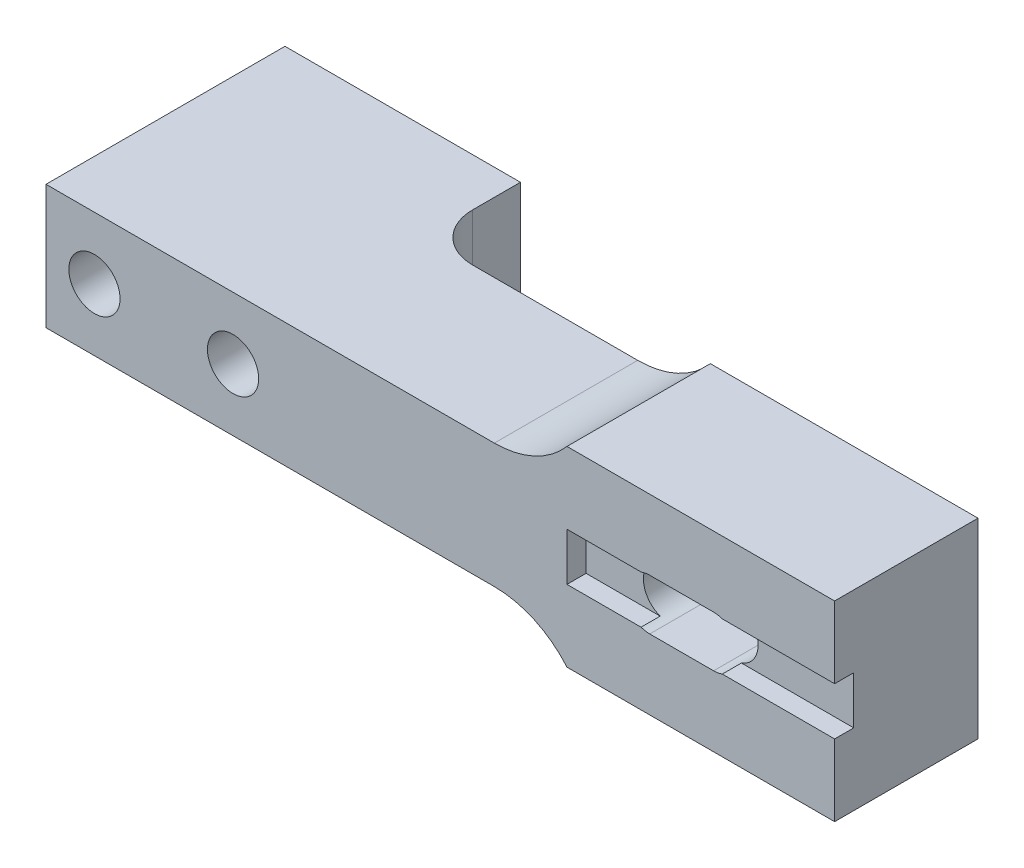
ISO-10303-21;
HEADER;
FILE_DESCRIPTION(('STEP AP214'),'2;1');
FILE_NAME('part.step','',(''),(''),'','','');
FILE_SCHEMA(('AUTOMOTIVE_DESIGN { 1 0 10303 214 1 1 1 1 }'));
ENDSEC;
DATA;
#1=APPLICATION_CONTEXT('core data for automotive mechanical design processes');
#2=APPLICATION_PROTOCOL_DEFINITION('international standard','automotive_design',2000,#1);
#3=PRODUCT_CONTEXT('',#1,'mechanical');
#4=PRODUCT('Part','Part','',(#3));
#5=PRODUCT_RELATED_PRODUCT_CATEGORY('part','',(#4));
#6=PRODUCT_DEFINITION_FORMATION('','',#4);
#7=PRODUCT_DEFINITION_CONTEXT('part definition',#1,'design');
#8=PRODUCT_DEFINITION('design','',#6,#7);
#9=PRODUCT_DEFINITION_SHAPE('','',#8);
#10=(LENGTH_UNIT() NAMED_UNIT(*) SI_UNIT(.MILLI.,.METRE.));
#11=(NAMED_UNIT(*) PLANE_ANGLE_UNIT() SI_UNIT($,.RADIAN.));
#12=(NAMED_UNIT(*) SI_UNIT($,.STERADIAN.) SOLID_ANGLE_UNIT());
#13=UNCERTAINTY_MEASURE_WITH_UNIT(LENGTH_MEASURE(1.E-05),#10,'distance_accuracy_value','');
#14=(GEOMETRIC_REPRESENTATION_CONTEXT(3) GLOBAL_UNCERTAINTY_ASSIGNED_CONTEXT((#13)) GLOBAL_UNIT_ASSIGNED_CONTEXT((#10,
#11,#12)) REPRESENTATION_CONTEXT('',''));
#15=CARTESIAN_POINT('',(0.,0.,0.));
#16=DIRECTION('',(0.,0.,1.));
#17=DIRECTION('',(1.,0.,0.));
#18=AXIS2_PLACEMENT_3D('',#15,#16,#17);
#19=CARTESIAN_POINT('',(0.,13.,10.));
#20=DIRECTION('',(0.,-1.,0.));
#21=DIRECTION('',(1.,0.,0.));
#22=AXIS2_PLACEMENT_3D('',#19,#20,#21);
#23=PLANE('',#22);
#24=DIRECTION('',(-1.,0.,0.));
#25=VECTOR('',#24,1.);
#26=CARTESIAN_POINT('',(0.,13.,25.));
#27=LINE('',#26,#25);
#28=CARTESIAN_POINT('',(46.9006579232147,13.,25.));
#29=VERTEX_POINT('',#28);
#30=CARTESIAN_POINT('',(0.,13.,25.));
#31=VERTEX_POINT('',#30);
#32=EDGE_CURVE('E301',#29,#31,#27,.T.);
#33=ORIENTED_EDGE('',*,*,#32,.F.);
#34=DIRECTION('',(0.,0.,-1.));
#35=VECTOR('',#34,1.);
#36=CARTESIAN_POINT('',(46.9006579232147,13.,10.));
#37=LINE('',#36,#35);
#38=CARTESIAN_POINT('',(46.9006579232147,13.,10.));
#39=VERTEX_POINT('',#38);
#40=EDGE_CURVE('E345',#29,#39,#37,.T.);
#41=ORIENTED_EDGE('',*,*,#40,.T.);
#42=DIRECTION('',(-1.,0.,0.));
#43=VECTOR('',#42,1.);
#44=CARTESIAN_POINT('',(0.,13.,10.));
#45=LINE('',#44,#43);
#46=CARTESIAN_POINT('',(29.634,13.,10.));
#47=VERTEX_POINT('',#46);
#48=EDGE_CURVE('E294',#39,#47,#45,.T.);
#49=ORIENTED_EDGE('',*,*,#48,.T.);
#50=CARTESIAN_POINT('',(29.634,13.,5.));
#51=DIRECTION('',(0.,-1.,0.));
#52=DIRECTION('',(1.,0.,0.));
#53=AXIS2_PLACEMENT_3D('',#50,#51,#52);
#54=CIRCLE('',#53,5.);
#55=CARTESIAN_POINT('',(24.634,13.,5.));
#56=VERTEX_POINT('',#55);
#57=EDGE_CURVE('E42',#47,#56,#54,.T.);
#58=ORIENTED_EDGE('',*,*,#57,.T.);
#59=DIRECTION('',(0.,0.,-1.));
#60=VECTOR('',#59,1.);
#61=CARTESIAN_POINT('',(24.634,13.,10.));
#62=LINE('',#61,#60);
#63=CARTESIAN_POINT('',(24.634,13.,0.));
#64=VERTEX_POINT('',#63);
#65=EDGE_CURVE('E321',#56,#64,#62,.T.);
#66=ORIENTED_EDGE('',*,*,#65,.T.);
#67=DIRECTION('',(-1.,0.,0.));
#68=VECTOR('',#67,1.);
#69=CARTESIAN_POINT('',(0.,13.,0.));
#70=LINE('',#69,#68);
#71=CARTESIAN_POINT('',(0.,13.,0.));
#72=VERTEX_POINT('',#71);
#73=EDGE_CURVE('E316',#64,#72,#70,.T.);
#74=ORIENTED_EDGE('',*,*,#73,.T.);
#75=DIRECTION('',(0.,0.,-1.));
#76=VECTOR('',#75,1.);
#77=CARTESIAN_POINT('',(0.,13.,10.));
#78=LINE('',#77,#76);
#79=EDGE_CURVE('E318',#31,#72,#78,.T.);
#80=ORIENTED_EDGE('',*,*,#79,.F.);
#81=EDGE_LOOP('',(#33,#41,#49,#58,#66,#74,#80));
#82=FACE_BOUND('',#81,.T.);
#83=ADVANCED_FACE('F34',(#82),#23,.F.);
#84=CARTESIAN_POINT('',(0.,13.,10.));
#85=DIRECTION('',(1.,0.,0.));
#86=DIRECTION('',(0.,0.,-1.));
#87=AXIS2_PLACEMENT_3D('',#84,#85,#86);
#88=PLANE('',#87);
#89=DIRECTION('',(0.,-1.,0.));
#90=VECTOR('',#89,1.);
#91=CARTESIAN_POINT('',(0.,13.,0.));
#92=LINE('',#91,#90);
#93=CARTESIAN_POINT('',(0.,0.,0.));
#94=VERTEX_POINT('',#93);
#95=EDGE_CURVE('E303',#72,#94,#92,.T.);
#96=ORIENTED_EDGE('',*,*,#95,.T.);
#97=DIRECTION('',(0.,0.,-1.));
#98=VECTOR('',#97,1.);
#99=CARTESIAN_POINT('',(0.,0.,10.));
#100=LINE('',#99,#98);
#101=CARTESIAN_POINT('',(0.,0.,25.));
#102=VERTEX_POINT('',#101);
#103=EDGE_CURVE('E325',#102,#94,#100,.T.);
#104=ORIENTED_EDGE('',*,*,#103,.F.);
#105=DIRECTION('',(0.,-1.,0.));
#106=VECTOR('',#105,1.);
#107=CARTESIAN_POINT('',(0.,0.,25.));
#108=LINE('',#107,#106);
#109=EDGE_CURVE('E290',#31,#102,#108,.T.);
#110=ORIENTED_EDGE('',*,*,#109,.F.);
#111=ORIENTED_EDGE('',*,*,#79,.T.);
#112=EDGE_LOOP('',(#96,#104,#110,#111));
#113=FACE_BOUND('',#112,.T.);
#114=ADVANCED_FACE('F402',(#113),#88,.F.);
#115=CARTESIAN_POINT('',(0.,0.,10.));
#116=DIRECTION('',(0.,1.,0.));
#117=DIRECTION('',(0.,0.,1.));
#118=AXIS2_PLACEMENT_3D('',#115,#116,#117);
#119=PLANE('',#118);
#120=DIRECTION('',(0.,0.,-1.));
#121=VECTOR('',#120,1.);
#122=CARTESIAN_POINT('',(24.634,0.,10.));
#123=LINE('',#122,#121);
#124=CARTESIAN_POINT('',(24.634,0.,5.));
#125=VERTEX_POINT('',#124);
#126=CARTESIAN_POINT('',(24.634,0.,0.));
#127=VERTEX_POINT('',#126);
#128=EDGE_CURVE('E323',#125,#127,#123,.T.);
#129=ORIENTED_EDGE('',*,*,#128,.F.);
#130=CARTESIAN_POINT('',(29.634,0.,5.));
#131=DIRECTION('',(0.,1.,0.));
#132=DIRECTION('',(0.,0.,1.));
#133=AXIS2_PLACEMENT_3D('',#130,#131,#132);
#134=CIRCLE('',#133,5.);
#135=CARTESIAN_POINT('',(29.634,0.,10.));
#136=VERTEX_POINT('',#135);
#137=EDGE_CURVE('E11',#125,#136,#134,.T.);
#138=ORIENTED_EDGE('',*,*,#137,.T.);
#139=DIRECTION('',(1.,0.,0.));
#140=VECTOR('',#139,1.);
#141=CARTESIAN_POINT('',(0.,0.,10.));
#142=LINE('',#141,#140);
#143=CARTESIAN_POINT('',(46.9006579232147,0.,10.));
#144=VERTEX_POINT('',#143);
#145=EDGE_CURVE('E289',#136,#144,#142,.T.);
#146=ORIENTED_EDGE('',*,*,#145,.T.);
#147=DIRECTION('',(0.,0.,1.));
#148=VECTOR('',#147,1.);
#149=CARTESIAN_POINT('',(46.9006579232147,0.,10.));
#150=LINE('',#149,#148);
#151=CARTESIAN_POINT('',(46.9006579232147,0.,25.));
#152=VERTEX_POINT('',#151);
#153=EDGE_CURVE('E347',#144,#152,#150,.T.);
#154=ORIENTED_EDGE('',*,*,#153,.T.);
#155=DIRECTION('',(1.,0.,0.));
#156=VECTOR('',#155,1.);
#157=CARTESIAN_POINT('',(0.,0.,25.));
#158=LINE('',#157,#156);
#159=EDGE_CURVE('E293',#102,#152,#158,.T.);
#160=ORIENTED_EDGE('',*,*,#159,.F.);
#161=ORIENTED_EDGE('',*,*,#103,.T.);
#162=DIRECTION('',(1.,0.,0.));
#163=VECTOR('',#162,1.);
#164=CARTESIAN_POINT('',(0.,0.,0.));
#165=LINE('',#164,#163);
#166=EDGE_CURVE('E310',#94,#127,#165,.T.);
#167=ORIENTED_EDGE('',*,*,#166,.T.);
#168=EDGE_LOOP('',(#129,#138,#146,#154,#160,#161,#167));
#169=FACE_BOUND('',#168,.T.);
#170=ADVANCED_FACE('F396',(#169),#119,.F.);
#171=CARTESIAN_POINT('',(24.634,13.,10.));
#172=DIRECTION('',(-1.,0.,0.));
#173=DIRECTION('',(0.,0.,1.));
#174=AXIS2_PLACEMENT_3D('',#171,#172,#173);
#175=PLANE('',#174);
#176=ORIENTED_EDGE('',*,*,#65,.F.);
#177=DIRECTION('',(0.,1.,0.));
#178=VECTOR('',#177,1.);
#179=CARTESIAN_POINT('',(24.634,13.,5.));
#180=LINE('',#179,#178);
#181=EDGE_CURVE('E49',#56,#125,#180,.F.);
#182=ORIENTED_EDGE('',*,*,#181,.T.);
#183=ORIENTED_EDGE('',*,*,#128,.T.);
#184=DIRECTION('',(0.,1.,0.));
#185=VECTOR('',#184,1.);
#186=CARTESIAN_POINT('',(24.634,13.,0.));
#187=LINE('',#186,#185);
#188=EDGE_CURVE('E313',#127,#64,#187,.T.);
#189=ORIENTED_EDGE('',*,*,#188,.T.);
#190=EDGE_LOOP('',(#176,#182,#183,#189));
#191=FACE_BOUND('',#190,.T.);
#192=ADVANCED_FACE('F408',(#191),#175,.F.);
#193=CARTESIAN_POINT('',(0.,0.,0.));
#194=DIRECTION('',(0.,0.,1.));
#195=DIRECTION('',(1.,0.,0.));
#196=AXIS2_PLACEMENT_3D('',#193,#194,#195);
#197=PLANE('',#196);
#198=CARTESIAN_POINT('',(5.067,6.5,0.));
#199=DIRECTION('',(0.,0.,-1.));
#200=DIRECTION('',(-1.,0.,0.));
#201=AXIS2_PLACEMENT_3D('',#198,#199,#200);
#202=CIRCLE('',#201,2.68);
#203=CARTESIAN_POINT('',(2.387,6.5,0.));
#204=VERTEX_POINT('',#203);
#205=EDGE_CURVE('E490',#204,#204,#202,.T.);
#206=ORIENTED_EDGE('',*,*,#205,.F.);
#207=EDGE_LOOP('',(#206));
#208=FACE_BOUND('',#207,.T.);
#209=CARTESIAN_POINT('',(19.567,6.5,0.));
#210=DIRECTION('',(0.,0.,-1.));
#211=DIRECTION('',(-1.,0.,0.));
#212=AXIS2_PLACEMENT_3D('',#209,#210,#211);
#213=CIRCLE('',#212,2.68);
#214=CARTESIAN_POINT('',(16.887,6.5,0.));
#215=VERTEX_POINT('',#214);
#216=EDGE_CURVE('E219',#215,#215,#213,.T.);
#217=ORIENTED_EDGE('',*,*,#216,.F.);
#218=EDGE_LOOP('',(#217));
#219=FACE_BOUND('',#218,.T.);
#220=ORIENTED_EDGE('',*,*,#95,.F.);
#221=ORIENTED_EDGE('',*,*,#73,.F.);
#222=ORIENTED_EDGE('',*,*,#188,.F.);
#223=ORIENTED_EDGE('',*,*,#166,.F.);
#224=EDGE_LOOP('',(#220,#221,#222,#223));
#225=FACE_BOUND('',#224,.T.);
#226=ADVANCED_FACE('F407',(#208,#219,#225),#197,.F.);
#227=CARTESIAN_POINT('',(82.5,0.,25.));
#228=DIRECTION('',(-1.,0.,0.));
#229=DIRECTION('',(0.,0.,1.));
#230=AXIS2_PLACEMENT_3D('',#227,#228,#229);
#231=PLANE('',#230);
#232=DIRECTION('',(0.,1.,0.));
#233=VECTOR('',#232,1.);
#234=CARTESIAN_POINT('',(82.5,0.,25.));
#235=LINE('',#234,#233);
#236=CARTESIAN_POINT('',(82.5,9.00000000000001,25.));
#237=VERTEX_POINT('',#236);
#238=CARTESIAN_POINT('',(82.5,16.5,25.));
#239=VERTEX_POINT('',#238);
#240=EDGE_CURVE('E297',#237,#239,#235,.T.);
#241=ORIENTED_EDGE('',*,*,#240,.F.);
#242=DIRECTION('',(0.,0.,1.));
#243=VECTOR('',#242,1.);
#244=CARTESIAN_POINT('',(82.5,9.00000000000001,23.));
#245=LINE('',#244,#243);
#246=CARTESIAN_POINT('',(82.5,9.00000000000001,23.));
#247=VERTEX_POINT('',#246);
#248=EDGE_CURVE('E232',#247,#237,#245,.T.);
#249=ORIENTED_EDGE('',*,*,#248,.F.);
#250=DIRECTION('',(0.,1.,0.));
#251=VECTOR('',#250,1.);
#252=CARTESIAN_POINT('',(82.5,9.00000000000001,23.));
#253=LINE('',#252,#251);
#254=CARTESIAN_POINT('',(82.5,4.,23.));
#255=VERTEX_POINT('',#254);
#256=EDGE_CURVE('E207',#255,#247,#253,.T.);
#257=ORIENTED_EDGE('',*,*,#256,.F.);
#258=DIRECTION('',(0.,0.,1.));
#259=VECTOR('',#258,1.);
#260=CARTESIAN_POINT('',(82.5,4.,23.));
#261=LINE('',#260,#259);
#262=CARTESIAN_POINT('',(82.5,4.,25.));
#263=VERTEX_POINT('',#262);
#264=EDGE_CURVE('E197',#255,#263,#261,.T.);
#265=ORIENTED_EDGE('',*,*,#264,.T.);
#266=CARTESIAN_POINT('',(82.5,-3.5,25.));
#267=VERTEX_POINT('',#266);
#268=EDGE_CURVE('E298',#267,#263,#235,.T.);
#269=ORIENTED_EDGE('',*,*,#268,.F.);
#270=DIRECTION('',(0.,0.,1.));
#271=VECTOR('',#270,1.);
#272=CARTESIAN_POINT('',(82.5,-3.5,-18.2179021190449));
#273=LINE('',#272,#271);
#274=CARTESIAN_POINT('',(82.5,-3.5,10.));
#275=VERTEX_POINT('',#274);
#276=EDGE_CURVE('E283',#275,#267,#273,.T.);
#277=ORIENTED_EDGE('',*,*,#276,.F.);
#278=DIRECTION('',(0.,1.,0.));
#279=VECTOR('',#278,1.);
#280=CARTESIAN_POINT('',(82.5,0.,10.));
#281=LINE('',#280,#279);
#282=CARTESIAN_POINT('',(82.5,16.5,10.));
#283=VERTEX_POINT('',#282);
#284=EDGE_CURVE('E305',#275,#283,#281,.T.);
#285=ORIENTED_EDGE('',*,*,#284,.T.);
#286=DIRECTION('',(0.,0.,1.));
#287=VECTOR('',#286,1.);
#288=CARTESIAN_POINT('',(82.5,16.5,-18.2179021190449));
#289=LINE('',#288,#287);
#290=EDGE_CURVE('E274',#283,#239,#289,.T.);
#291=ORIENTED_EDGE('',*,*,#290,.T.);
#292=EDGE_LOOP('',(#241,#249,#257,#265,#269,#277,#285,#291));
#293=FACE_BOUND('',#292,.T.);
#294=ADVANCED_FACE('F383',(#293),#231,.F.);
#295=CARTESIAN_POINT('',(0.,0.,25.));
#296=DIRECTION('',(0.,0.,-1.));
#297=DIRECTION('',(-1.,0.,0.));
#298=AXIS2_PLACEMENT_3D('',#295,#296,#297);
#299=PLANE('',#298);
#300=CARTESIAN_POINT('',(5.067,6.5,25.));
#301=DIRECTION('',(0.,0.,-1.));
#302=DIRECTION('',(-1.,0.,0.));
#303=AXIS2_PLACEMENT_3D('',#300,#301,#302);
#304=CIRCLE('',#303,2.68);
#305=CARTESIAN_POINT('',(2.387,6.5,25.));
#306=VERTEX_POINT('',#305);
#307=EDGE_CURVE('E226',#306,#306,#304,.T.);
#308=ORIENTED_EDGE('',*,*,#307,.T.);
#309=EDGE_LOOP('',(#308));
#310=FACE_BOUND('',#309,.T.);
#311=CARTESIAN_POINT('',(19.567,6.5,25.));
#312=DIRECTION('',(0.,0.,-1.));
#313=DIRECTION('',(-1.,0.,0.));
#314=AXIS2_PLACEMENT_3D('',#311,#312,#313);
#315=CIRCLE('',#314,2.68);
#316=CARTESIAN_POINT('',(16.887,6.5,25.));
#317=VERTEX_POINT('',#316);
#318=EDGE_CURVE('E494',#317,#317,#315,.T.);
#319=ORIENTED_EDGE('',*,*,#318,.T.);
#320=EDGE_LOOP('',(#319));
#321=FACE_BOUND('',#320,.T.);
#322=CARTESIAN_POINT('',(69.84,6.5,25.));
#323=DIRECTION('',(0.,0.,1.));
#324=DIRECTION('',(1.,0.,0.));
#325=AXIS2_PLACEMENT_3D('',#322,#323,#324);
#326=CIRCLE('',#325,2.66);
#327=CARTESIAN_POINT('',(70.7486253353281,9.00000000000001,25.));
#328=VERTEX_POINT('',#327);
#329=CARTESIAN_POINT('',(69.84,9.16,25.));
#330=VERTEX_POINT('',#329);
#331=EDGE_CURVE('E248',#328,#330,#326,.T.);
#332=ORIENTED_EDGE('',*,*,#331,.F.);
#333=DIRECTION('',(-1.,0.,0.));
#334=VECTOR('',#333,1.);
#335=CARTESIAN_POINT('',(54.5,9.00000000000001,25.));
#336=LINE('',#335,#334);
#337=EDGE_CURVE('E214',#237,#328,#336,.T.);
#338=ORIENTED_EDGE('',*,*,#337,.F.);
#339=ORIENTED_EDGE('',*,*,#240,.T.);
#340=DIRECTION('',(-1.,0.,0.));
#341=VECTOR('',#340,1.);
#342=CARTESIAN_POINT('',(54.5,16.5,25.));
#343=LINE('',#342,#341);
#344=CARTESIAN_POINT('',(54.5,16.5,25.));
#345=VERTEX_POINT('',#344);
#346=EDGE_CURVE('E258',#239,#345,#343,.T.);
#347=ORIENTED_EDGE('',*,*,#346,.T.);
#348=CARTESIAN_POINT('',(46.9006579232147,23.,25.));
#349=DIRECTION('',(0.,0.,-1.));
#350=DIRECTION('',(-1.,0.,0.));
#351=AXIS2_PLACEMENT_3D('',#348,#349,#350);
#352=CIRCLE('',#351,10.);
#353=EDGE_CURVE('E350',#345,#29,#352,.T.);
#354=ORIENTED_EDGE('',*,*,#353,.T.);
#355=ORIENTED_EDGE('',*,*,#32,.T.);
#356=ORIENTED_EDGE('',*,*,#109,.T.);
#357=ORIENTED_EDGE('',*,*,#159,.T.);
#358=CARTESIAN_POINT('',(46.9006579232147,-10.,25.));
#359=DIRECTION('',(0.,0.,-1.));
#360=DIRECTION('',(-1.,0.,0.));
#361=AXIS2_PLACEMENT_3D('',#358,#359,#360);
#362=CIRCLE('',#361,10.);
#363=CARTESIAN_POINT('',(54.5,-3.5,25.));
#364=VERTEX_POINT('',#363);
#365=EDGE_CURVE('E354',#152,#364,#362,.T.);
#366=ORIENTED_EDGE('',*,*,#365,.T.);
#367=DIRECTION('',(1.,0.,0.));
#368=VECTOR('',#367,1.);
#369=CARTESIAN_POINT('',(54.5,-3.5,25.));
#370=LINE('',#369,#368);
#371=EDGE_CURVE('E277',#364,#267,#370,.T.);
#372=ORIENTED_EDGE('',*,*,#371,.T.);
#373=ORIENTED_EDGE('',*,*,#268,.T.);
#374=DIRECTION('',(1.,0.,0.));
#375=VECTOR('',#374,1.);
#376=CARTESIAN_POINT('',(54.5,4.,25.));
#377=LINE('',#376,#375);
#378=CARTESIAN_POINT('',(70.7486253353281,4.,25.));
#379=VERTEX_POINT('',#378);
#380=EDGE_CURVE('E225',#379,#263,#377,.T.);
#381=ORIENTED_EDGE('',*,*,#380,.F.);
#382=CARTESIAN_POINT('',(69.84,3.84,25.));
#383=VERTEX_POINT('',#382);
#384=EDGE_CURVE('E249',#383,#379,#326,.T.);
#385=ORIENTED_EDGE('',*,*,#384,.F.);
#386=DIRECTION('',(1.,0.,0.));
#387=VECTOR('',#386,1.);
#388=CARTESIAN_POINT('',(63.16,3.84,25.));
#389=LINE('',#388,#387);
#390=CARTESIAN_POINT('',(63.16,3.84,25.));
#391=VERTEX_POINT('',#390);
#392=EDGE_CURVE('E245',#391,#383,#389,.T.);
#393=ORIENTED_EDGE('',*,*,#392,.F.);
#394=CARTESIAN_POINT('',(63.16,6.5,25.));
#395=DIRECTION('',(0.,0.,1.));
#396=DIRECTION('',(1.,0.,0.));
#397=AXIS2_PLACEMENT_3D('',#394,#395,#396);
#398=CIRCLE('',#397,2.66);
#399=CARTESIAN_POINT('',(62.2513746646719,4.,25.));
#400=VERTEX_POINT('',#399);
#401=EDGE_CURVE('E241',#400,#391,#398,.T.);
#402=ORIENTED_EDGE('',*,*,#401,.F.);
#403=CARTESIAN_POINT('',(54.5,4.,25.));
#404=VERTEX_POINT('',#403);
#405=EDGE_CURVE('E227',#404,#400,#377,.T.);
#406=ORIENTED_EDGE('',*,*,#405,.F.);
#407=DIRECTION('',(0.,-1.,0.));
#408=VECTOR('',#407,1.);
#409=CARTESIAN_POINT('',(54.5,9.00000000000001,25.));
#410=LINE('',#409,#408);
#411=CARTESIAN_POINT('',(54.5,9.00000000000001,25.));
#412=VERTEX_POINT('',#411);
#413=EDGE_CURVE('E194',#412,#404,#410,.T.);
#414=ORIENTED_EDGE('',*,*,#413,.F.);
#415=CARTESIAN_POINT('',(62.2513746646719,9.00000000000001,25.));
#416=VERTEX_POINT('',#415);
#417=EDGE_CURVE('E216',#416,#412,#336,.T.);
#418=ORIENTED_EDGE('',*,*,#417,.F.);
#419=CARTESIAN_POINT('',(63.16,9.16,25.));
#420=VERTEX_POINT('',#419);
#421=EDGE_CURVE('E242',#420,#416,#398,.T.);
#422=ORIENTED_EDGE('',*,*,#421,.F.);
#423=DIRECTION('',(-1.,0.,0.));
#424=VECTOR('',#423,1.);
#425=CARTESIAN_POINT('',(63.16,9.16,25.));
#426=LINE('',#425,#424);
#427=EDGE_CURVE('E252',#330,#420,#426,.T.);
#428=ORIENTED_EDGE('',*,*,#427,.F.);
#429=EDGE_LOOP('',(#332,#338,#339,#347,#354,#355,#356,#357,#366,#372,#373,#381,#385,#393,#402,
#406,#414,#418,#422,#428));
#430=FACE_BOUND('',#429,.T.);
#431=ADVANCED_FACE('F399',(#310,#321,#430),#299,.F.);
#432=CARTESIAN_POINT('',(0.,0.,10.));
#433=DIRECTION('',(0.,0.,-1.));
#434=DIRECTION('',(-1.,0.,0.));
#435=AXIS2_PLACEMENT_3D('',#432,#433,#434);
#436=PLANE('',#435);
#437=CARTESIAN_POINT('',(63.16,6.5,10.));
#438=DIRECTION('',(0.,0.,-1.));
#439=DIRECTION('',(-1.,0.,0.));
#440=AXIS2_PLACEMENT_3D('',#437,#438,#439);
#441=CIRCLE('',#440,2.66);
#442=CARTESIAN_POINT('',(63.16,3.84,10.));
#443=VERTEX_POINT('',#442);
#444=CARTESIAN_POINT('',(63.16,9.16,10.));
#445=VERTEX_POINT('',#444);
#446=EDGE_CURVE('E335',#443,#445,#441,.T.);
#447=ORIENTED_EDGE('',*,*,#446,.F.);
#448=DIRECTION('',(-1.,0.,0.));
#449=VECTOR('',#448,1.);
#450=CARTESIAN_POINT('',(0.,3.84000000000002,10.));
#451=LINE('',#450,#449);
#452=CARTESIAN_POINT('',(69.84,3.84,10.));
#453=VERTEX_POINT('',#452);
#454=EDGE_CURVE('E328',#453,#443,#451,.T.);
#455=ORIENTED_EDGE('',*,*,#454,.F.);
#456=CARTESIAN_POINT('',(69.84,6.5,10.));
#457=DIRECTION('',(0.,0.,-1.));
#458=DIRECTION('',(-1.,0.,0.));
#459=AXIS2_PLACEMENT_3D('',#456,#457,#458);
#460=CIRCLE('',#459,2.66);
#461=CARTESIAN_POINT('',(69.84,9.16,10.));
#462=VERTEX_POINT('',#461);
#463=EDGE_CURVE('E330',#462,#453,#460,.T.);
#464=ORIENTED_EDGE('',*,*,#463,.F.);
#465=DIRECTION('',(1.,0.,0.));
#466=VECTOR('',#465,1.);
#467=CARTESIAN_POINT('',(0.,9.15999999999999,10.));
#468=LINE('',#467,#466);
#469=EDGE_CURVE('E333',#445,#462,#468,.T.);
#470=ORIENTED_EDGE('',*,*,#469,.F.);
#471=EDGE_LOOP('',(#447,#455,#464,#470));
#472=FACE_BOUND('',#471,.T.);
#473=ORIENTED_EDGE('',*,*,#145,.F.);
#474=DIRECTION('',(0.,1.,0.));
#475=VECTOR('',#474,1.);
#476=CARTESIAN_POINT('',(29.634,0.,10.));
#477=LINE('',#476,#475);
#478=EDGE_CURVE('E359',#136,#47,#477,.T.);
#479=ORIENTED_EDGE('',*,*,#478,.T.);
#480=ORIENTED_EDGE('',*,*,#48,.F.);
#481=CARTESIAN_POINT('',(46.9006579232147,23.,10.));
#482=DIRECTION('',(0.,0.,-1.));
#483=DIRECTION('',(-1.,0.,0.));
#484=AXIS2_PLACEMENT_3D('',#481,#482,#483);
#485=CIRCLE('',#484,10.);
#486=CARTESIAN_POINT('',(54.5,16.5,10.));
#487=VERTEX_POINT('',#486);
#488=EDGE_CURVE('E352',#39,#487,#485,.F.);
#489=ORIENTED_EDGE('',*,*,#488,.T.);
#490=DIRECTION('',(-1.,0.,0.));
#491=VECTOR('',#490,1.);
#492=CARTESIAN_POINT('',(54.5,16.5,10.));
#493=LINE('',#492,#491);
#494=EDGE_CURVE('E268',#283,#487,#493,.T.);
#495=ORIENTED_EDGE('',*,*,#494,.F.);
#496=ORIENTED_EDGE('',*,*,#284,.F.);
#497=DIRECTION('',(1.,0.,0.));
#498=VECTOR('',#497,1.);
#499=CARTESIAN_POINT('',(54.5,-3.5,10.));
#500=LINE('',#499,#498);
#501=CARTESIAN_POINT('',(54.5,-3.5,10.));
#502=VERTEX_POINT('',#501);
#503=EDGE_CURVE('E280',#502,#275,#500,.T.);
#504=ORIENTED_EDGE('',*,*,#503,.F.);
#505=CARTESIAN_POINT('',(46.9006579232147,-10.,10.));
#506=DIRECTION('',(0.,0.,-1.));
#507=DIRECTION('',(-1.,0.,0.));
#508=AXIS2_PLACEMENT_3D('',#505,#506,#507);
#509=CIRCLE('',#508,10.);
#510=EDGE_CURVE('E356',#502,#144,#509,.F.);
#511=ORIENTED_EDGE('',*,*,#510,.T.);
#512=EDGE_LOOP('',(#473,#479,#480,#489,#495,#496,#504,#511));
#513=FACE_BOUND('',#512,.T.);
#514=ADVANCED_FACE('F366',(#472,#513),#436,.T.);
#515=CARTESIAN_POINT('',(54.5,-3.5,-18.2179021190449));
#516=DIRECTION('',(0.,-1.,0.));
#517=DIRECTION('',(0.,0.,-1.));
#518=AXIS2_PLACEMENT_3D('',#515,#516,#517);
#519=PLANE('',#518);
#520=DIRECTION('',(0.,0.,1.));
#521=VECTOR('',#520,1.);
#522=CARTESIAN_POINT('',(54.5,-3.5,-18.2179021190449));
#523=LINE('',#522,#521);
#524=EDGE_CURVE('E286',#502,#364,#523,.T.);
#525=ORIENTED_EDGE('',*,*,#524,.F.);
#526=ORIENTED_EDGE('',*,*,#503,.T.);
#527=ORIENTED_EDGE('',*,*,#276,.T.);
#528=ORIENTED_EDGE('',*,*,#371,.F.);
#529=EDGE_LOOP('',(#525,#526,#527,#528));
#530=FACE_BOUND('',#529,.T.);
#531=ADVANCED_FACE('F391',(#530),#519,.T.);
#532=CARTESIAN_POINT('',(54.5,16.5,-18.2179021190449));
#533=DIRECTION('',(0.,1.,0.));
#534=DIRECTION('',(0.,0.,1.));
#535=AXIS2_PLACEMENT_3D('',#532,#533,#534);
#536=PLANE('',#535);
#537=ORIENTED_EDGE('',*,*,#290,.F.);
#538=ORIENTED_EDGE('',*,*,#494,.T.);
#539=DIRECTION('',(0.,0.,1.));
#540=VECTOR('',#539,1.);
#541=CARTESIAN_POINT('',(54.5,16.5,-18.2179021190449));
#542=LINE('',#541,#540);
#543=EDGE_CURVE('E271',#487,#345,#542,.T.);
#544=ORIENTED_EDGE('',*,*,#543,.T.);
#545=ORIENTED_EDGE('',*,*,#346,.F.);
#546=EDGE_LOOP('',(#537,#538,#544,#545));
#547=FACE_BOUND('',#546,.T.);
#548=ADVANCED_FACE('F379',(#547),#536,.T.);
#549=CARTESIAN_POINT('',(63.16,6.5,0.));
#550=DIRECTION('',(0.,0.,1.));
#551=DIRECTION('',(1.,0.,0.));
#552=AXIS2_PLACEMENT_3D('',#549,#550,#551);
#553=CYLINDRICAL_SURFACE('',#552,2.66);
#554=ORIENTED_EDGE('',*,*,#421,.T.);
#555=DIRECTION('',(0.,0.,1.));
#556=VECTOR('',#555,1.);
#557=CARTESIAN_POINT('',(62.2513746646719,9.00000000000001,0.));
#558=LINE('',#557,#556);
#559=CARTESIAN_POINT('',(62.2513746646719,9.00000000000001,23.));
#560=VERTEX_POINT('',#559);
#561=EDGE_CURVE('E238',#416,#560,#558,.F.);
#562=ORIENTED_EDGE('',*,*,#561,.T.);
#563=CARTESIAN_POINT('',(63.16,6.5,23.));
#564=DIRECTION('',(0.,0.,1.));
#565=DIRECTION('',(1.,0.,0.));
#566=AXIS2_PLACEMENT_3D('',#563,#564,#565);
#567=CIRCLE('',#566,2.66);
#568=CARTESIAN_POINT('',(62.2513746646719,4.,23.));
#569=VERTEX_POINT('',#568);
#570=EDGE_CURVE('E231',#569,#560,#567,.F.);
#571=ORIENTED_EDGE('',*,*,#570,.F.);
#572=DIRECTION('',(0.,0.,1.));
#573=VECTOR('',#572,1.);
#574=CARTESIAN_POINT('',(62.2513746646719,4.,0.));
#575=LINE('',#574,#573);
#576=EDGE_CURVE('E204',#569,#400,#575,.T.);
#577=ORIENTED_EDGE('',*,*,#576,.T.);
#578=ORIENTED_EDGE('',*,*,#401,.T.);
#579=DIRECTION('',(0.,0.,1.));
#580=VECTOR('',#579,1.);
#581=CARTESIAN_POINT('',(63.16,3.84,0.));
#582=LINE('',#581,#580);
#583=EDGE_CURVE('E255',#443,#391,#582,.T.);
#584=ORIENTED_EDGE('',*,*,#583,.F.);
#585=ORIENTED_EDGE('',*,*,#446,.T.);
#586=DIRECTION('',(0.,0.,1.));
#587=VECTOR('',#586,1.);
#588=CARTESIAN_POINT('',(63.16,9.16,0.));
#589=LINE('',#588,#587);
#590=EDGE_CURVE('E256',#445,#420,#589,.T.);
#591=ORIENTED_EDGE('',*,*,#590,.T.);
#592=EDGE_LOOP('',(#554,#562,#571,#577,#578,#584,#585,#591));
#593=FACE_BOUND('',#592,.T.);
#594=ADVANCED_FACE('F459',(#593),#553,.F.);
#595=CARTESIAN_POINT('',(63.16,9.16,0.));
#596=DIRECTION('',(0.,1.,0.));
#597=DIRECTION('',(-1.,0.,0.));
#598=AXIS2_PLACEMENT_3D('',#595,#596,#597);
#599=PLANE('',#598);
#600=ORIENTED_EDGE('',*,*,#469,.T.);
#601=DIRECTION('',(0.,0.,1.));
#602=VECTOR('',#601,1.);
#603=CARTESIAN_POINT('',(69.84,9.16,0.));
#604=LINE('',#603,#602);
#605=EDGE_CURVE('E259',#462,#330,#604,.T.);
#606=ORIENTED_EDGE('',*,*,#605,.T.);
#607=ORIENTED_EDGE('',*,*,#427,.T.);
#608=ORIENTED_EDGE('',*,*,#590,.F.);
#609=EDGE_LOOP('',(#600,#606,#607,#608));
#610=FACE_BOUND('',#609,.T.);
#611=ADVANCED_FACE('F455',(#610),#599,.F.);
#612=CARTESIAN_POINT('',(69.84,6.5,0.));
#613=DIRECTION('',(0.,0.,1.));
#614=DIRECTION('',(1.,0.,0.));
#615=AXIS2_PLACEMENT_3D('',#612,#613,#614);
#616=CYLINDRICAL_SURFACE('',#615,2.66);
#617=CARTESIAN_POINT('',(69.84,6.5,23.));
#618=DIRECTION('',(0.,0.,1.));
#619=DIRECTION('',(1.,0.,0.));
#620=AXIS2_PLACEMENT_3D('',#617,#618,#619);
#621=CIRCLE('',#620,2.66);
#622=CARTESIAN_POINT('',(70.7486253353281,9.00000000000001,23.));
#623=VERTEX_POINT('',#622);
#624=CARTESIAN_POINT('',(70.7486253353281,4.,23.));
#625=VERTEX_POINT('',#624);
#626=EDGE_CURVE('E337',#623,#625,#621,.F.);
#627=ORIENTED_EDGE('',*,*,#626,.F.);
#628=DIRECTION('',(0.,0.,1.));
#629=VECTOR('',#628,1.);
#630=CARTESIAN_POINT('',(70.7486253353281,9.00000000000001,0.));
#631=LINE('',#630,#629);
#632=EDGE_CURVE('E342',#623,#328,#631,.T.);
#633=ORIENTED_EDGE('',*,*,#632,.T.);
#634=ORIENTED_EDGE('',*,*,#331,.T.);
#635=ORIENTED_EDGE('',*,*,#605,.F.);
#636=ORIENTED_EDGE('',*,*,#463,.T.);
#637=DIRECTION('',(0.,0.,1.));
#638=VECTOR('',#637,1.);
#639=CARTESIAN_POINT('',(69.84,3.84,0.));
#640=LINE('',#639,#638);
#641=EDGE_CURVE('E262',#453,#383,#640,.T.);
#642=ORIENTED_EDGE('',*,*,#641,.T.);
#643=ORIENTED_EDGE('',*,*,#384,.T.);
#644=DIRECTION('',(0.,0.,1.));
#645=VECTOR('',#644,1.);
#646=CARTESIAN_POINT('',(70.7486253353281,4.,0.));
#647=LINE('',#646,#645);
#648=EDGE_CURVE('E339',#379,#625,#647,.F.);
#649=ORIENTED_EDGE('',*,*,#648,.T.);
#650=EDGE_LOOP('',(#627,#633,#634,#635,#636,#642,#643,#649));
#651=FACE_BOUND('',#650,.T.);
#652=ADVANCED_FACE('F458',(#651),#616,.F.);
#653=CARTESIAN_POINT('',(63.16,3.84,0.));
#654=DIRECTION('',(0.,-1.,0.));
#655=DIRECTION('',(1.,0.,0.));
#656=AXIS2_PLACEMENT_3D('',#653,#654,#655);
#657=PLANE('',#656);
#658=ORIENTED_EDGE('',*,*,#454,.T.);
#659=ORIENTED_EDGE('',*,*,#583,.T.);
#660=ORIENTED_EDGE('',*,*,#392,.T.);
#661=ORIENTED_EDGE('',*,*,#641,.F.);
#662=EDGE_LOOP('',(#658,#659,#660,#661));
#663=FACE_BOUND('',#662,.T.);
#664=ADVANCED_FACE('F463',(#663),#657,.F.);
#665=CARTESIAN_POINT('',(0.,0.,23.));
#666=DIRECTION('',(0.,0.,1.));
#667=DIRECTION('',(1.,0.,0.));
#668=AXIS2_PLACEMENT_3D('',#665,#666,#667);
#669=PLANE('',#668);
#670=ORIENTED_EDGE('',*,*,#626,.T.);
#671=DIRECTION('',(1.,0.,0.));
#672=VECTOR('',#671,1.);
#673=CARTESIAN_POINT('',(54.5,4.,23.));
#674=LINE('',#673,#672);
#675=EDGE_CURVE('E208',#625,#255,#674,.T.);
#676=ORIENTED_EDGE('',*,*,#675,.T.);
#677=ORIENTED_EDGE('',*,*,#256,.T.);
#678=DIRECTION('',(-1.,0.,0.));
#679=VECTOR('',#678,1.);
#680=CARTESIAN_POINT('',(54.5,9.00000000000001,23.));
#681=LINE('',#680,#679);
#682=EDGE_CURVE('E198',#247,#623,#681,.T.);
#683=ORIENTED_EDGE('',*,*,#682,.T.);
#684=EDGE_LOOP('',(#670,#676,#677,#683));
#685=FACE_BOUND('',#684,.T.);
#686=ADVANCED_FACE('F444',(#685),#669,.T.);
#687=CARTESIAN_POINT('',(54.5,4.,23.));
#688=DIRECTION('',(0.,-1.,0.));
#689=DIRECTION('',(1.,0.,0.));
#690=AXIS2_PLACEMENT_3D('',#687,#688,#689);
#691=PLANE('',#690);
#692=ORIENTED_EDGE('',*,*,#380,.T.);
#693=ORIENTED_EDGE('',*,*,#264,.F.);
#694=ORIENTED_EDGE('',*,*,#675,.F.);
#695=ORIENTED_EDGE('',*,*,#648,.F.);
#696=EDGE_LOOP('',(#692,#693,#694,#695));
#697=FACE_BOUND('',#696,.T.);
#698=ADVANCED_FACE('F452',(#697),#691,.F.);
#699=CARTESIAN_POINT('',(54.5,9.00000000000001,23.));
#700=DIRECTION('',(0.,1.,0.));
#701=DIRECTION('',(0.,0.,1.));
#702=AXIS2_PLACEMENT_3D('',#699,#700,#701);
#703=PLANE('',#702);
#704=ORIENTED_EDGE('',*,*,#682,.F.);
#705=ORIENTED_EDGE('',*,*,#248,.T.);
#706=ORIENTED_EDGE('',*,*,#337,.T.);
#707=ORIENTED_EDGE('',*,*,#632,.F.);
#708=EDGE_LOOP('',(#704,#705,#706,#707));
#709=FACE_BOUND('',#708,.T.);
#710=ADVANCED_FACE('F448',(#709),#703,.F.);
#711=ORIENTED_EDGE('',*,*,#417,.T.);
#712=DIRECTION('',(0.,0.,1.));
#713=VECTOR('',#712,1.);
#714=CARTESIAN_POINT('',(54.5,9.00000000000001,23.));
#715=LINE('',#714,#713);
#716=CARTESIAN_POINT('',(54.5,9.00000000000001,23.));
#717=VERTEX_POINT('',#716);
#718=EDGE_CURVE('E229',#717,#412,#715,.T.);
#719=ORIENTED_EDGE('',*,*,#718,.F.);
#720=EDGE_CURVE('E212',#560,#717,#681,.T.);
#721=ORIENTED_EDGE('',*,*,#720,.F.);
#722=ORIENTED_EDGE('',*,*,#561,.F.);
#723=EDGE_LOOP('',(#711,#719,#721,#722));
#724=FACE_BOUND('',#723,.T.);
#725=ADVANCED_FACE('F445',(#724),#703,.F.);
#726=CARTESIAN_POINT('',(54.5,4.,23.));
#727=VERTEX_POINT('',#726);
#728=EDGE_CURVE('E201',#727,#569,#674,.T.);
#729=ORIENTED_EDGE('',*,*,#728,.F.);
#730=DIRECTION('',(0.,0.,1.));
#731=VECTOR('',#730,1.);
#732=CARTESIAN_POINT('',(54.5,4.,23.));
#733=LINE('',#732,#731);
#734=EDGE_CURVE('E187',#727,#404,#733,.T.);
#735=ORIENTED_EDGE('',*,*,#734,.T.);
#736=ORIENTED_EDGE('',*,*,#405,.T.);
#737=ORIENTED_EDGE('',*,*,#576,.F.);
#738=EDGE_LOOP('',(#729,#735,#736,#737));
#739=FACE_BOUND('',#738,.T.);
#740=ADVANCED_FACE('F202',(#739),#691,.F.);
#741=ORIENTED_EDGE('',*,*,#570,.T.);
#742=ORIENTED_EDGE('',*,*,#720,.T.);
#743=DIRECTION('',(0.,-1.,0.));
#744=VECTOR('',#743,1.);
#745=CARTESIAN_POINT('',(54.5,9.00000000000001,23.));
#746=LINE('',#745,#744);
#747=EDGE_CURVE('E192',#717,#727,#746,.T.);
#748=ORIENTED_EDGE('',*,*,#747,.T.);
#749=ORIENTED_EDGE('',*,*,#728,.T.);
#750=EDGE_LOOP('',(#741,#742,#748,#749));
#751=FACE_BOUND('',#750,.T.);
#752=ADVANCED_FACE('F210',(#751),#669,.T.);
#753=CARTESIAN_POINT('',(54.5,9.00000000000001,23.));
#754=DIRECTION('',(-1.,0.,0.));
#755=DIRECTION('',(0.,0.,1.));
#756=AXIS2_PLACEMENT_3D('',#753,#754,#755);
#757=PLANE('',#756);
#758=ORIENTED_EDGE('',*,*,#413,.T.);
#759=ORIENTED_EDGE('',*,*,#734,.F.);
#760=ORIENTED_EDGE('',*,*,#747,.F.);
#761=ORIENTED_EDGE('',*,*,#718,.T.);
#762=EDGE_LOOP('',(#758,#759,#760,#761));
#763=FACE_BOUND('',#762,.T.);
#764=ADVANCED_FACE('F189',(#763),#757,.F.);
#765=CARTESIAN_POINT('',(19.567,6.5,25.));
#766=DIRECTION('',(0.,0.,-1.));
#767=DIRECTION('',(-1.,0.,0.));
#768=AXIS2_PLACEMENT_3D('',#765,#766,#767);
#769=CYLINDRICAL_SURFACE('',#768,2.68);
#770=ORIENTED_EDGE('',*,*,#318,.F.);
#771=EDGE_LOOP('',(#770));
#772=FACE_BOUND('',#771,.T.);
#773=ORIENTED_EDGE('',*,*,#216,.T.);
#774=EDGE_LOOP('',(#773));
#775=FACE_BOUND('',#774,.T.);
#776=ADVANCED_FACE('F431',(#772,#775),#769,.F.);
#777=CARTESIAN_POINT('',(5.067,6.5,25.));
#778=DIRECTION('',(0.,0.,-1.));
#779=DIRECTION('',(-1.,0.,0.));
#780=AXIS2_PLACEMENT_3D('',#777,#778,#779);
#781=CYLINDRICAL_SURFACE('',#780,2.68);
#782=ORIENTED_EDGE('',*,*,#307,.F.);
#783=EDGE_LOOP('',(#782));
#784=FACE_BOUND('',#783,.T.);
#785=ORIENTED_EDGE('',*,*,#205,.T.);
#786=EDGE_LOOP('',(#785));
#787=FACE_BOUND('',#786,.T.);
#788=ADVANCED_FACE('F427',(#784,#787),#781,.F.);
#789=CARTESIAN_POINT('',(46.9006579232147,23.,-18.2179021190449));
#790=DIRECTION('',(0.,0.,-1.));
#791=DIRECTION('',(-1.,0.,0.));
#792=AXIS2_PLACEMENT_3D('',#789,#790,#791);
#793=CYLINDRICAL_SURFACE('',#792,10.);
#794=ORIENTED_EDGE('',*,*,#488,.F.);
#795=ORIENTED_EDGE('',*,*,#40,.F.);
#796=ORIENTED_EDGE('',*,*,#353,.F.);
#797=ORIENTED_EDGE('',*,*,#543,.F.);
#798=EDGE_LOOP('',(#794,#795,#796,#797));
#799=FACE_BOUND('',#798,.T.);
#800=ADVANCED_FACE('F374',(#799),#793,.F.);
#801=CARTESIAN_POINT('',(46.9006579232147,-10.,-18.2179021190449));
#802=DIRECTION('',(0.,0.,1.));
#803=DIRECTION('',(1.,0.,0.));
#804=AXIS2_PLACEMENT_3D('',#801,#802,#803);
#805=CYLINDRICAL_SURFACE('',#804,10.);
#806=ORIENTED_EDGE('',*,*,#510,.F.);
#807=ORIENTED_EDGE('',*,*,#524,.T.);
#808=ORIENTED_EDGE('',*,*,#365,.F.);
#809=ORIENTED_EDGE('',*,*,#153,.F.);
#810=EDGE_LOOP('',(#806,#807,#808,#809));
#811=FACE_BOUND('',#810,.T.);
#812=ADVANCED_FACE('F393',(#811),#805,.F.);
#813=CARTESIAN_POINT('',(29.634,0.,5.));
#814=DIRECTION('',(0.,1.,0.));
#815=DIRECTION('',(0.,0.,1.));
#816=AXIS2_PLACEMENT_3D('',#813,#814,#815);
#817=CYLINDRICAL_SURFACE('',#816,5.);
#818=ORIENTED_EDGE('',*,*,#137,.F.);
#819=ORIENTED_EDGE('',*,*,#181,.F.);
#820=ORIENTED_EDGE('',*,*,#57,.F.);
#821=ORIENTED_EDGE('',*,*,#478,.F.);
#822=EDGE_LOOP('',(#818,#819,#820,#821));
#823=FACE_BOUND('',#822,.T.);
#824=ADVANCED_FACE('F36',(#823),#817,.F.);
#825=CLOSED_SHELL('',(#83,#114,#170,#192,#226,#294,#431,#514,#531,#548,#594,#611,#652,#664,#686,
#698,#710,#725,#740,#752,#764,#776,#788,#800,#812,#824));
#826=MANIFOLD_SOLID_BREP('B2',#825);
#827=ADVANCED_BREP_SHAPE_REPRESENTATION('',(#18,#826),#14);
#828=SHAPE_DEFINITION_REPRESENTATION(#9,#827);
ENDSEC;
END-ISO-10303-21;
